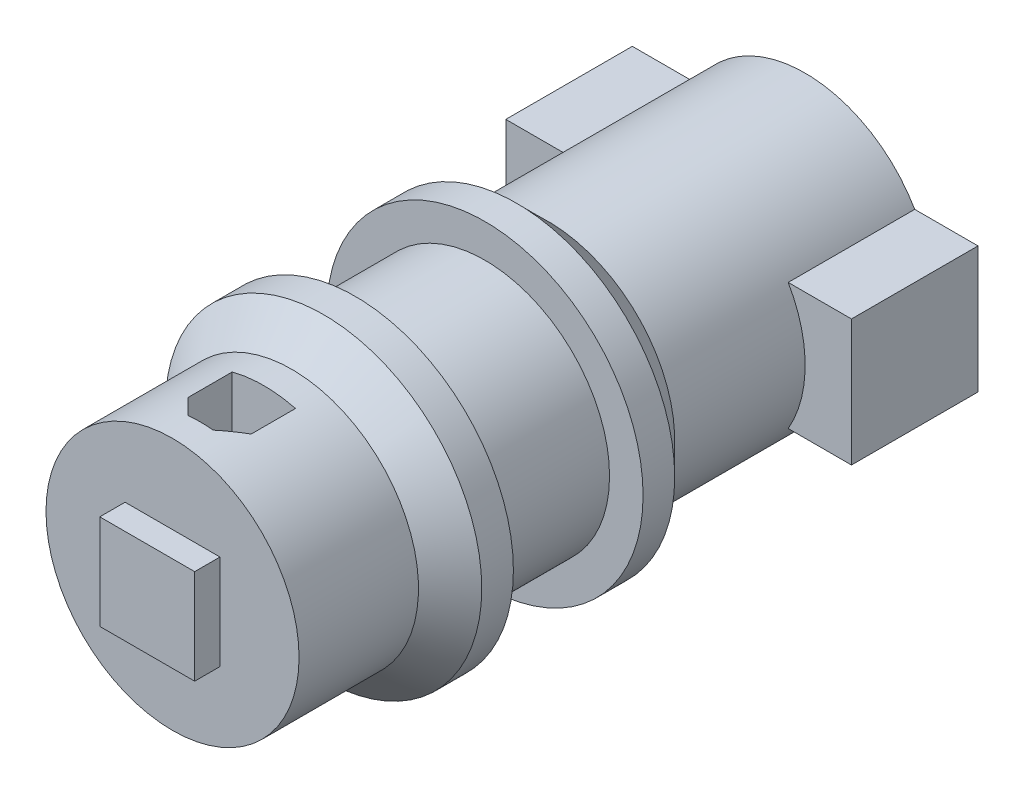
ISO-10303-21;
HEADER;
FILE_DESCRIPTION(('STEP AP214'),'2;1');
FILE_NAME('part.step','',(''),(''),'','','');
FILE_SCHEMA(('AUTOMOTIVE_DESIGN { 1 0 10303 214 1 1 1 1 }'));
ENDSEC;
DATA;
#1=APPLICATION_CONTEXT('core data for automotive mechanical design processes');
#2=APPLICATION_PROTOCOL_DEFINITION('international standard','automotive_design',2000,#1);
#3=PRODUCT_CONTEXT('',#1,'mechanical');
#4=PRODUCT('Part','Part','',(#3));
#5=PRODUCT_RELATED_PRODUCT_CATEGORY('part','',(#4));
#6=PRODUCT_DEFINITION_FORMATION('','',#4);
#7=PRODUCT_DEFINITION_CONTEXT('part definition',#1,'design');
#8=PRODUCT_DEFINITION('design','',#6,#7);
#9=PRODUCT_DEFINITION_SHAPE('','',#8);
#10=(LENGTH_UNIT() NAMED_UNIT(*) SI_UNIT(.MILLI.,.METRE.));
#11=(NAMED_UNIT(*) PLANE_ANGLE_UNIT() SI_UNIT($,.RADIAN.));
#12=(NAMED_UNIT(*) SI_UNIT($,.STERADIAN.) SOLID_ANGLE_UNIT());
#13=UNCERTAINTY_MEASURE_WITH_UNIT(LENGTH_MEASURE(1.E-05),#10,'distance_accuracy_value','');
#14=(GEOMETRIC_REPRESENTATION_CONTEXT(3) GLOBAL_UNCERTAINTY_ASSIGNED_CONTEXT((#13)) GLOBAL_UNIT_ASSIGNED_CONTEXT((#10,
#11,#12)) REPRESENTATION_CONTEXT('',''));
#15=CARTESIAN_POINT('',(0.,0.,0.));
#16=DIRECTION('',(0.,0.,1.));
#17=DIRECTION('',(1.,0.,0.));
#18=AXIS2_PLACEMENT_3D('',#15,#16,#17);
#19=CARTESIAN_POINT('',(0.,0.,35.56));
#20=DIRECTION('',(0.,0.,1.));
#21=DIRECTION('',(1.,0.,0.));
#22=AXIS2_PLACEMENT_3D('',#19,#20,#21);
#23=CYLINDRICAL_SURFACE('',#22,12.5);
#24=CARTESIAN_POINT('',(0.,0.,38.06));
#25=DIRECTION('',(0.,0.,-1.));
#26=DIRECTION('',(-1.,0.,0.));
#27=AXIS2_PLACEMENT_3D('',#24,#25,#26);
#28=CIRCLE('',#27,12.5);
#29=CARTESIAN_POINT('',(-12.5,0.,38.06));
#30=VERTEX_POINT('',#29);
#31=EDGE_CURVE('E336',#30,#30,#28,.T.);
#32=ORIENTED_EDGE('',*,*,#31,.T.);
#33=EDGE_LOOP('',(#32));
#34=FACE_BOUND('',#33,.T.);
#35=CARTESIAN_POINT('',(0.,0.,35.56));
#36=DIRECTION('',(0.,0.,-1.));
#37=DIRECTION('',(-1.,0.,0.));
#38=AXIS2_PLACEMENT_3D('',#35,#36,#37);
#39=CIRCLE('',#38,12.5);
#40=CARTESIAN_POINT('',(-12.5,0.,35.56));
#41=VERTEX_POINT('',#40);
#42=EDGE_CURVE('E230',#41,#41,#39,.T.);
#43=ORIENTED_EDGE('',*,*,#42,.F.);
#44=EDGE_LOOP('',(#43));
#45=FACE_BOUND('',#44,.T.);
#46=ADVANCED_FACE('F52',(#34,#45),#23,.T.);
#47=CARTESIAN_POINT('',(0.,0.,35.56));
#48=DIRECTION('',(0.,0.,-1.));
#49=DIRECTION('',(-1.,0.,0.));
#50=AXIS2_PLACEMENT_3D('',#47,#48,#49);
#51=PLANE('',#50);
#52=ORIENTED_EDGE('',*,*,#42,.T.);
#53=EDGE_LOOP('',(#52));
#54=FACE_BOUND('',#53,.T.);
#55=CARTESIAN_POINT('',(0.,0.,35.56));
#56=DIRECTION('',(0.,0.,-1.));
#57=DIRECTION('',(-1.,0.,0.));
#58=AXIS2_PLACEMENT_3D('',#55,#56,#57);
#59=CIRCLE('',#58,9.85);
#60=CARTESIAN_POINT('',(-9.85,0.,35.56));
#61=VERTEX_POINT('',#60);
#62=EDGE_CURVE('E529',#61,#61,#59,.T.);
#63=ORIENTED_EDGE('',*,*,#62,.F.);
#64=EDGE_LOOP('',(#63));
#65=FACE_BOUND('',#64,.T.);
#66=ADVANCED_FACE('F420',(#54,#65),#51,.T.);
#67=CARTESIAN_POINT('',(0.,0.,50.));
#68=DIRECTION('',(0.,0.,1.));
#69=DIRECTION('',(1.,0.,0.));
#70=AXIS2_PLACEMENT_3D('',#67,#68,#69);
#71=PLANE('',#70);
#72=DIRECTION('',(0.,1.,0.));
#73=VECTOR('',#72,1.);
#74=CARTESIAN_POINT('',(3.75,-3.75,50.));
#75=LINE('',#74,#73);
#76=CARTESIAN_POINT('',(3.75,-3.75,50.));
#77=VERTEX_POINT('',#76);
#78=CARTESIAN_POINT('',(3.75,3.75,50.));
#79=VERTEX_POINT('',#78);
#80=EDGE_CURVE('E69',#77,#79,#75,.T.);
#81=ORIENTED_EDGE('',*,*,#80,.F.);
#82=DIRECTION('',(1.,0.,0.));
#83=VECTOR('',#82,1.);
#84=CARTESIAN_POINT('',(-3.75,-3.75,50.));
#85=LINE('',#84,#83);
#86=CARTESIAN_POINT('',(-3.75,-3.75,50.));
#87=VERTEX_POINT('',#86);
#88=EDGE_CURVE('E73',#87,#77,#85,.T.);
#89=ORIENTED_EDGE('',*,*,#88,.F.);
#90=DIRECTION('',(0.,-1.,0.));
#91=VECTOR('',#90,1.);
#92=CARTESIAN_POINT('',(-3.75,-3.75,50.));
#93=LINE('',#92,#91);
#94=CARTESIAN_POINT('',(-3.75,3.75,50.));
#95=VERTEX_POINT('',#94);
#96=EDGE_CURVE('E551',#95,#87,#93,.T.);
#97=ORIENTED_EDGE('',*,*,#96,.F.);
#98=DIRECTION('',(-1.,0.,0.));
#99=VECTOR('',#98,1.);
#100=CARTESIAN_POINT('',(-3.75,3.75,50.));
#101=LINE('',#100,#99);
#102=EDGE_CURVE('E548',#79,#95,#101,.T.);
#103=ORIENTED_EDGE('',*,*,#102,.F.);
#104=EDGE_LOOP('',(#81,#89,#97,#103));
#105=FACE_BOUND('',#104,.T.);
#106=CARTESIAN_POINT('',(0.,0.,50.));
#107=DIRECTION('',(0.,0.,1.));
#108=DIRECTION('',(1.,0.,0.));
#109=AXIS2_PLACEMENT_3D('',#106,#107,#108);
#110=CIRCLE('',#109,10.);
#111=CARTESIAN_POINT('',(10.,0.,50.));
#112=VERTEX_POINT('',#111);
#113=EDGE_CURVE('E322',#112,#112,#110,.T.);
#114=ORIENTED_EDGE('',*,*,#113,.T.);
#115=EDGE_LOOP('',(#114));
#116=FACE_BOUND('',#115,.T.);
#117=ADVANCED_FACE('F426',(#105,#116),#71,.T.);
#118=CARTESIAN_POINT('',(0.,0.,50.));
#119=DIRECTION('',(0.,0.,-1.));
#120=DIRECTION('',(-1.,0.,0.));
#121=AXIS2_PLACEMENT_3D('',#118,#119,#120);
#122=CYLINDRICAL_SURFACE('',#121,10.);
#123=CARTESIAN_POINT('',(0.,0.,47.78));
#124=DIRECTION('',(0.,0.,1.));
#125=DIRECTION('',(1.,0.,0.));
#126=AXIS2_PLACEMENT_3D('',#123,#124,#125);
#127=CIRCLE('',#126,10.);
#128=CARTESIAN_POINT('',(1.00000000000002,9.9498743710662,47.78));
#129=VERTEX_POINT('',#128);
#130=CARTESIAN_POINT('',(-0.999999999999985,9.9498743710662,47.78));
#131=VERTEX_POINT('',#130);
#132=EDGE_CURVE('E348',#129,#131,#127,.T.);
#133=ORIENTED_EDGE('',*,*,#132,.T.);
#134=CARTESIAN_POINT('',(0.,0.,48.78));
#135=DIRECTION('',(0.707106781186544,0.,-0.707106781186551));
#136=DIRECTION('',(-0.707106781186551,0.,-0.707106781186544));
#137=AXIS2_PLACEMENT_3D('',#134,#135,#136);
#138=ELLIPSE('',#137,14.1421356237309,10.);
#139=CARTESIAN_POINT('',(-2.5,9.68245836551854,46.28));
#140=VERTEX_POINT('',#139);
#141=EDGE_CURVE('E12',#131,#140,#138,.F.);
#142=ORIENTED_EDGE('',*,*,#141,.T.);
#143=DIRECTION('',(0.,0.,-1.));
#144=VECTOR('',#143,1.);
#145=CARTESIAN_POINT('',(-2.5,9.68245836551854,50.));
#146=LINE('',#145,#144);
#147=CARTESIAN_POINT('',(-2.5,9.68245836551854,42.78));
#148=VERTEX_POINT('',#147);
#149=EDGE_CURVE('E356',#140,#148,#146,.T.);
#150=ORIENTED_EDGE('',*,*,#149,.T.);
#151=CARTESIAN_POINT('',(0.,0.,42.78));
#152=DIRECTION('',(0.,0.,-1.));
#153=DIRECTION('',(-1.,0.,0.));
#154=AXIS2_PLACEMENT_3D('',#151,#152,#153);
#155=CIRCLE('',#154,10.);
#156=CARTESIAN_POINT('',(2.5,9.68245836551854,42.78));
#157=VERTEX_POINT('',#156);
#158=EDGE_CURVE('E344',#148,#157,#155,.T.);
#159=ORIENTED_EDGE('',*,*,#158,.T.);
#160=DIRECTION('',(0.,0.,-1.));
#161=VECTOR('',#160,1.);
#162=CARTESIAN_POINT('',(2.5,9.68245836551854,50.));
#163=LINE('',#162,#161);
#164=CARTESIAN_POINT('',(2.5,9.68245836551854,46.28));
#165=VERTEX_POINT('',#164);
#166=EDGE_CURVE('E352',#157,#165,#163,.F.);
#167=ORIENTED_EDGE('',*,*,#166,.T.);
#168=CARTESIAN_POINT('',(0.,0.,48.78));
#169=DIRECTION('',(-0.707106781186554,0.,-0.707106781186541));
#170=DIRECTION('',(0.707106781186541,0.,-0.707106781186554));
#171=AXIS2_PLACEMENT_3D('',#168,#169,#170);
#172=ELLIPSE('',#171,14.1421356237311,10.);
#173=EDGE_CURVE('E62',#165,#129,#172,.F.);
#174=ORIENTED_EDGE('',*,*,#173,.T.);
#175=EDGE_LOOP('',(#133,#142,#150,#159,#167,#174));
#176=FACE_BOUND('',#175,.T.);
#177=ORIENTED_EDGE('',*,*,#113,.F.);
#178=EDGE_LOOP('',(#177));
#179=FACE_BOUND('',#178,.T.);
#180=CARTESIAN_POINT('',(0.,0.,40.56));
#181=DIRECTION('',(0.,0.,-1.));
#182=DIRECTION('',(-1.,0.,0.));
#183=AXIS2_PLACEMENT_3D('',#180,#181,#182);
#184=CIRCLE('',#183,10.);
#185=CARTESIAN_POINT('',(-10.,0.,40.56));
#186=VERTEX_POINT('',#185);
#187=EDGE_CURVE('E326',#186,#186,#184,.T.);
#188=ORIENTED_EDGE('',*,*,#187,.F.);
#189=EDGE_LOOP('',(#188));
#190=FACE_BOUND('',#189,.T.);
#191=ADVANCED_FACE('F382',(#176,#179,#190),#122,.T.);
#192=CARTESIAN_POINT('',(0.,0.,38.06));
#193=DIRECTION('',(0.,0.,-1.));
#194=DIRECTION('',(-1.,0.,0.));
#195=AXIS2_PLACEMENT_3D('',#192,#193,#194);
#196=CONICAL_SURFACE('',#195,12.5,0.785398163397449);
#197=ORIENTED_EDGE('',*,*,#187,.T.);
#198=EDGE_LOOP('',(#197));
#199=FACE_BOUND('',#198,.T.);
#200=ORIENTED_EDGE('',*,*,#31,.F.);
#201=EDGE_LOOP('',(#200));
#202=FACE_BOUND('',#201,.T.);
#203=ADVANCED_FACE('F485',(#199,#202),#196,.T.);
#204=CARTESIAN_POINT('',(2.5,5.,47.78));
#205=DIRECTION('',(1.,0.,0.));
#206=DIRECTION('',(0.,0.,-1.));
#207=AXIS2_PLACEMENT_3D('',#204,#205,#206);
#208=PLANE('',#207);
#209=DIRECTION('',(0.,0.,-1.));
#210=VECTOR('',#209,1.);
#211=CARTESIAN_POINT('',(2.5,5.,47.78));
#212=LINE('',#211,#210);
#213=CARTESIAN_POINT('',(2.5,5.,46.28));
#214=VERTEX_POINT('',#213);
#215=CARTESIAN_POINT('',(2.5,5.,42.78));
#216=VERTEX_POINT('',#215);
#217=EDGE_CURVE('E201',#214,#216,#212,.T.);
#218=ORIENTED_EDGE('',*,*,#217,.F.);
#219=DIRECTION('',(0.,1.,0.));
#220=VECTOR('',#219,1.);
#221=CARTESIAN_POINT('',(2.5,9.68245836551854,46.28));
#222=LINE('',#221,#220);
#223=EDGE_CURVE('E359',#214,#165,#222,.T.);
#224=ORIENTED_EDGE('',*,*,#223,.T.);
#225=ORIENTED_EDGE('',*,*,#166,.F.);
#226=DIRECTION('',(0.,1.,0.));
#227=VECTOR('',#226,1.);
#228=CARTESIAN_POINT('',(2.5,5.,42.78));
#229=LINE('',#228,#227);
#230=EDGE_CURVE('E225',#216,#157,#229,.T.);
#231=ORIENTED_EDGE('',*,*,#230,.F.);
#232=EDGE_LOOP('',(#218,#224,#225,#231));
#233=FACE_BOUND('',#232,.T.);
#234=ADVANCED_FACE('F399',(#233),#208,.F.);
#235=CARTESIAN_POINT('',(-2.5,5.,47.78));
#236=DIRECTION('',(0.,0.,1.));
#237=DIRECTION('',(1.,0.,0.));
#238=AXIS2_PLACEMENT_3D('',#235,#236,#237);
#239=PLANE('',#238);
#240=ORIENTED_EDGE('',*,*,#132,.F.);
#241=DIRECTION('',(0.,-1.,0.));
#242=VECTOR('',#241,1.);
#243=CARTESIAN_POINT('',(1.00000000000002,5.,47.78));
#244=LINE('',#243,#242);
#245=CARTESIAN_POINT('',(1.00000000000002,5.,47.78));
#246=VERTEX_POINT('',#245);
#247=EDGE_CURVE('E367',#129,#246,#244,.T.);
#248=ORIENTED_EDGE('',*,*,#247,.T.);
#249=DIRECTION('',(1.,0.,0.));
#250=VECTOR('',#249,1.);
#251=CARTESIAN_POINT('',(-2.5,5.,47.78));
#252=LINE('',#251,#250);
#253=CARTESIAN_POINT('',(-0.999999999999985,5.,47.78));
#254=VERTEX_POINT('',#253);
#255=EDGE_CURVE('E221',#254,#246,#252,.T.);
#256=ORIENTED_EDGE('',*,*,#255,.F.);
#257=DIRECTION('',(0.,1.,0.));
#258=VECTOR('',#257,1.);
#259=CARTESIAN_POINT('',(-0.999999999999985,9.68245836551854,47.78));
#260=LINE('',#259,#258);
#261=EDGE_CURVE('E363',#254,#131,#260,.T.);
#262=ORIENTED_EDGE('',*,*,#261,.T.);
#263=EDGE_LOOP('',(#240,#248,#256,#262));
#264=FACE_BOUND('',#263,.T.);
#265=ADVANCED_FACE('F389',(#264),#239,.F.);
#266=CARTESIAN_POINT('',(-2.5,5.,47.78));
#267=DIRECTION('',(-1.,0.,0.));
#268=DIRECTION('',(0.,0.,1.));
#269=AXIS2_PLACEMENT_3D('',#266,#267,#268);
#270=PLANE('',#269);
#271=ORIENTED_EDGE('',*,*,#149,.F.);
#272=DIRECTION('',(0.,-1.,0.));
#273=VECTOR('',#272,1.);
#274=CARTESIAN_POINT('',(-2.5,5.,46.28));
#275=LINE('',#274,#273);
#276=CARTESIAN_POINT('',(-2.5,5.,46.28));
#277=VERTEX_POINT('',#276);
#278=EDGE_CURVE('E376',#140,#277,#275,.T.);
#279=ORIENTED_EDGE('',*,*,#278,.T.);
#280=DIRECTION('',(0.,0.,1.));
#281=VECTOR('',#280,1.);
#282=CARTESIAN_POINT('',(-2.5,5.,47.78));
#283=LINE('',#282,#281);
#284=CARTESIAN_POINT('',(-2.5,5.,42.78));
#285=VERTEX_POINT('',#284);
#286=EDGE_CURVE('E217',#285,#277,#283,.T.);
#287=ORIENTED_EDGE('',*,*,#286,.F.);
#288=DIRECTION('',(0.,1.,0.));
#289=VECTOR('',#288,1.);
#290=CARTESIAN_POINT('',(-2.5,5.,42.78));
#291=LINE('',#290,#289);
#292=EDGE_CURVE('E226',#285,#148,#291,.T.);
#293=ORIENTED_EDGE('',*,*,#292,.T.);
#294=EDGE_LOOP('',(#271,#279,#287,#293));
#295=FACE_BOUND('',#294,.T.);
#296=ADVANCED_FACE('F410',(#295),#270,.F.);
#297=CARTESIAN_POINT('',(-2.5,5.,42.78));
#298=DIRECTION('',(0.,0.,-1.));
#299=DIRECTION('',(-1.,0.,0.));
#300=AXIS2_PLACEMENT_3D('',#297,#298,#299);
#301=PLANE('',#300);
#302=ORIENTED_EDGE('',*,*,#292,.F.);
#303=DIRECTION('',(-1.,0.,0.));
#304=VECTOR('',#303,1.);
#305=CARTESIAN_POINT('',(-2.5,5.,42.78));
#306=LINE('',#305,#304);
#307=EDGE_CURVE('E207',#216,#285,#306,.T.);
#308=ORIENTED_EDGE('',*,*,#307,.F.);
#309=ORIENTED_EDGE('',*,*,#230,.T.);
#310=ORIENTED_EDGE('',*,*,#158,.F.);
#311=EDGE_LOOP('',(#302,#308,#309,#310));
#312=FACE_BOUND('',#311,.T.);
#313=ADVANCED_FACE('F403',(#312),#301,.F.);
#314=CARTESIAN_POINT('',(0.,5.,0.));
#315=DIRECTION('',(0.,-1.,0.));
#316=DIRECTION('',(0.,0.,-1.));
#317=AXIS2_PLACEMENT_3D('',#314,#315,#316);
#318=PLANE('',#317);
#319=ORIENTED_EDGE('',*,*,#255,.T.);
#320=DIRECTION('',(-0.707106781186541,0.,0.707106781186554));
#321=VECTOR('',#320,1.);
#322=CARTESIAN_POINT('',(2.5,5.,46.28));
#323=LINE('',#322,#321);
#324=EDGE_CURVE('E373',#246,#214,#323,.F.);
#325=ORIENTED_EDGE('',*,*,#324,.T.);
#326=ORIENTED_EDGE('',*,*,#217,.T.);
#327=ORIENTED_EDGE('',*,*,#307,.T.);
#328=ORIENTED_EDGE('',*,*,#286,.T.);
#329=DIRECTION('',(-0.707106781186551,0.,-0.707106781186544));
#330=VECTOR('',#329,1.);
#331=CARTESIAN_POINT('',(-0.999999999999985,5.,47.78));
#332=LINE('',#331,#330);
#333=EDGE_CURVE('E370',#277,#254,#332,.F.);
#334=ORIENTED_EDGE('',*,*,#333,.T.);
#335=EDGE_LOOP('',(#319,#325,#326,#327,#328,#334));
#336=FACE_BOUND('',#335,.T.);
#337=ADVANCED_FACE('F396',(#336),#318,.F.);
#338=CARTESIAN_POINT('',(2.5,5.,46.28));
#339=DIRECTION('',(-0.707106781186554,0.,-0.707106781186541));
#340=DIRECTION('',(0.,-1.,0.));
#341=AXIS2_PLACEMENT_3D('',#338,#339,#340);
#342=PLANE('',#341);
#343=ORIENTED_EDGE('',*,*,#324,.F.);
#344=ORIENTED_EDGE('',*,*,#247,.F.);
#345=ORIENTED_EDGE('',*,*,#173,.F.);
#346=ORIENTED_EDGE('',*,*,#223,.F.);
#347=EDGE_LOOP('',(#343,#344,#345,#346));
#348=FACE_BOUND('',#347,.T.);
#349=ADVANCED_FACE('F393',(#348),#342,.T.);
#350=CARTESIAN_POINT('',(-0.999999999999985,5.,47.78));
#351=DIRECTION('',(0.707106781186544,0.,-0.707106781186551));
#352=DIRECTION('',(0.,-1.,0.));
#353=AXIS2_PLACEMENT_3D('',#350,#351,#352);
#354=PLANE('',#353);
#355=ORIENTED_EDGE('',*,*,#333,.F.);
#356=ORIENTED_EDGE('',*,*,#278,.F.);
#357=ORIENTED_EDGE('',*,*,#141,.F.);
#358=ORIENTED_EDGE('',*,*,#261,.F.);
#359=EDGE_LOOP('',(#355,#356,#357,#358));
#360=FACE_BOUND('',#359,.T.);
#361=ADVANCED_FACE('F55',(#360),#354,.T.);
#362=CARTESIAN_POINT('',(3.75,-3.75,52.));
#363=DIRECTION('',(-1.,0.,0.));
#364=DIRECTION('',(0.,0.,1.));
#365=AXIS2_PLACEMENT_3D('',#362,#363,#364);
#366=PLANE('',#365);
#367=ORIENTED_EDGE('',*,*,#80,.T.);
#368=DIRECTION('',(0.,0.,-1.));
#369=VECTOR('',#368,1.);
#370=CARTESIAN_POINT('',(3.75,3.75,52.));
#371=LINE('',#370,#369);
#372=CARTESIAN_POINT('',(3.75,3.75,52.));
#373=VERTEX_POINT('',#372);
#374=EDGE_CURVE('E181',#373,#79,#371,.T.);
#375=ORIENTED_EDGE('',*,*,#374,.F.);
#376=DIRECTION('',(0.,1.,0.));
#377=VECTOR('',#376,1.);
#378=CARTESIAN_POINT('',(3.75,-3.75,52.));
#379=LINE('',#378,#377);
#380=CARTESIAN_POINT('',(3.75,-3.75,52.));
#381=VERTEX_POINT('',#380);
#382=EDGE_CURVE('E188',#381,#373,#379,.T.);
#383=ORIENTED_EDGE('',*,*,#382,.F.);
#384=DIRECTION('',(0.,0.,-1.));
#385=VECTOR('',#384,1.);
#386=CARTESIAN_POINT('',(3.75,-3.75,52.));
#387=LINE('',#386,#385);
#388=EDGE_CURVE('E545',#381,#77,#387,.T.);
#389=ORIENTED_EDGE('',*,*,#388,.T.);
#390=EDGE_LOOP('',(#367,#375,#383,#389));
#391=FACE_BOUND('',#390,.T.);
#392=ADVANCED_FACE('F199',(#391),#366,.F.);
#393=CARTESIAN_POINT('',(-3.75,3.75,52.));
#394=DIRECTION('',(0.,-1.,0.));
#395=DIRECTION('',(0.,0.,-1.));
#396=AXIS2_PLACEMENT_3D('',#393,#394,#395);
#397=PLANE('',#396);
#398=ORIENTED_EDGE('',*,*,#102,.T.);
#399=DIRECTION('',(0.,0.,-1.));
#400=VECTOR('',#399,1.);
#401=CARTESIAN_POINT('',(-3.75,3.75,52.));
#402=LINE('',#401,#400);
#403=CARTESIAN_POINT('',(-3.75,3.75,52.));
#404=VERTEX_POINT('',#403);
#405=EDGE_CURVE('E183',#404,#95,#402,.T.);
#406=ORIENTED_EDGE('',*,*,#405,.F.);
#407=DIRECTION('',(-1.,0.,0.));
#408=VECTOR('',#407,1.);
#409=CARTESIAN_POINT('',(-3.75,3.75,52.));
#410=LINE('',#409,#408);
#411=EDGE_CURVE('E176',#373,#404,#410,.T.);
#412=ORIENTED_EDGE('',*,*,#411,.F.);
#413=ORIENTED_EDGE('',*,*,#374,.T.);
#414=EDGE_LOOP('',(#398,#406,#412,#413));
#415=FACE_BOUND('',#414,.T.);
#416=ADVANCED_FACE('F179',(#415),#397,.F.);
#417=CARTESIAN_POINT('',(-3.75,-3.75,52.));
#418=DIRECTION('',(1.,0.,0.));
#419=DIRECTION('',(0.,0.,-1.));
#420=AXIS2_PLACEMENT_3D('',#417,#418,#419);
#421=PLANE('',#420);
#422=ORIENTED_EDGE('',*,*,#96,.T.);
#423=DIRECTION('',(0.,0.,-1.));
#424=VECTOR('',#423,1.);
#425=CARTESIAN_POINT('',(-3.75,-3.75,52.));
#426=LINE('',#425,#424);
#427=CARTESIAN_POINT('',(-3.75,-3.75,52.));
#428=VERTEX_POINT('',#427);
#429=EDGE_CURVE('E210',#428,#87,#426,.T.);
#430=ORIENTED_EDGE('',*,*,#429,.F.);
#431=DIRECTION('',(0.,-1.,0.));
#432=VECTOR('',#431,1.);
#433=CARTESIAN_POINT('',(-3.75,-3.75,52.));
#434=LINE('',#433,#432);
#435=EDGE_CURVE('E187',#404,#428,#434,.T.);
#436=ORIENTED_EDGE('',*,*,#435,.F.);
#437=ORIENTED_EDGE('',*,*,#405,.T.);
#438=EDGE_LOOP('',(#422,#430,#436,#437));
#439=FACE_BOUND('',#438,.T.);
#440=ADVANCED_FACE('F512',(#439),#421,.F.);
#441=CARTESIAN_POINT('',(-3.75,-3.75,52.));
#442=DIRECTION('',(0.,1.,0.));
#443=DIRECTION('',(0.,0.,1.));
#444=AXIS2_PLACEMENT_3D('',#441,#442,#443);
#445=PLANE('',#444);
#446=ORIENTED_EDGE('',*,*,#88,.T.);
#447=ORIENTED_EDGE('',*,*,#388,.F.);
#448=DIRECTION('',(1.,0.,0.));
#449=VECTOR('',#448,1.);
#450=CARTESIAN_POINT('',(-3.75,-3.75,52.));
#451=LINE('',#450,#449);
#452=EDGE_CURVE('E193',#428,#381,#451,.T.);
#453=ORIENTED_EDGE('',*,*,#452,.F.);
#454=ORIENTED_EDGE('',*,*,#429,.T.);
#455=EDGE_LOOP('',(#446,#447,#453,#454));
#456=FACE_BOUND('',#455,.T.);
#457=ADVANCED_FACE('F515',(#456),#445,.F.);
#458=CARTESIAN_POINT('',(0.,0.,52.));
#459=DIRECTION('',(0.,0.,-1.));
#460=DIRECTION('',(-1.,0.,0.));
#461=AXIS2_PLACEMENT_3D('',#458,#459,#460);
#462=PLANE('',#461);
#463=ORIENTED_EDGE('',*,*,#382,.T.);
#464=ORIENTED_EDGE('',*,*,#411,.T.);
#465=ORIENTED_EDGE('',*,*,#435,.T.);
#466=ORIENTED_EDGE('',*,*,#452,.T.);
#467=EDGE_LOOP('',(#463,#464,#465,#466));
#468=FACE_BOUND('',#467,.T.);
#469=ADVANCED_FACE('F191',(#468),#462,.F.);
#470=CARTESIAN_POINT('',(0.,0.,63.8442712474619));
#471=DIRECTION('',(0.,0.,-1.));
#472=DIRECTION('',(-1.,0.,0.));
#473=AXIS2_PLACEMENT_3D('',#470,#471,#472);
#474=CYLINDRICAL_SURFACE('',#473,9.85);
#475=ORIENTED_EDGE('',*,*,#62,.T.);
#476=EDGE_LOOP('',(#475));
#477=FACE_BOUND('',#476,.T.);
#478=CARTESIAN_POINT('',(0.,0.,25.31));
#479=DIRECTION('',(0.,0.,1.));
#480=DIRECTION('',(1.,0.,0.));
#481=AXIS2_PLACEMENT_3D('',#478,#479,#480);
#482=CIRCLE('',#481,9.85);
#483=CARTESIAN_POINT('',(9.85,0.,25.31));
#484=VERTEX_POINT('',#483);
#485=EDGE_CURVE('E532',#484,#484,#482,.T.);
#486=ORIENTED_EDGE('',*,*,#485,.T.);
#487=EDGE_LOOP('',(#486));
#488=FACE_BOUND('',#487,.T.);
#489=ADVANCED_FACE('F451',(#477,#488),#474,.T.);
#490=CARTESIAN_POINT('',(-13.6602540378444,-5.,10.));
#491=DIRECTION('',(-1.,0.,0.));
#492=DIRECTION('',(0.,-1.,0.));
#493=AXIS2_PLACEMENT_3D('',#490,#491,#492);
#494=PLANE('',#493);
#495=DIRECTION('',(0.,1.,0.));
#496=VECTOR('',#495,1.);
#497=CARTESIAN_POINT('',(-13.6602540378444,-5.,0.));
#498=LINE('',#497,#496);
#499=CARTESIAN_POINT('',(-13.6602540378444,-5.,0.));
#500=VERTEX_POINT('',#499);
#501=CARTESIAN_POINT('',(-13.6602540378444,5.,0.));
#502=VERTEX_POINT('',#501);
#503=EDGE_CURVE('E258',#500,#502,#498,.T.);
#504=ORIENTED_EDGE('',*,*,#503,.F.);
#505=DIRECTION('',(0.,0.,-1.));
#506=VECTOR('',#505,1.);
#507=CARTESIAN_POINT('',(-13.6602540378444,-5.,10.));
#508=LINE('',#507,#506);
#509=CARTESIAN_POINT('',(-13.6602540378444,-5.,10.));
#510=VERTEX_POINT('',#509);
#511=EDGE_CURVE('E245',#510,#500,#508,.T.);
#512=ORIENTED_EDGE('',*,*,#511,.F.);
#513=DIRECTION('',(0.,1.,0.));
#514=VECTOR('',#513,1.);
#515=CARTESIAN_POINT('',(-13.6602540378444,-5.,10.));
#516=LINE('',#515,#514);
#517=CARTESIAN_POINT('',(-13.6602540378444,5.,10.));
#518=VERTEX_POINT('',#517);
#519=EDGE_CURVE('E271',#510,#518,#516,.T.);
#520=ORIENTED_EDGE('',*,*,#519,.T.);
#521=DIRECTION('',(0.,0.,-1.));
#522=VECTOR('',#521,1.);
#523=CARTESIAN_POINT('',(-13.6602540378444,5.,10.));
#524=LINE('',#523,#522);
#525=EDGE_CURVE('E247',#518,#502,#524,.T.);
#526=ORIENTED_EDGE('',*,*,#525,.T.);
#527=EDGE_LOOP('',(#504,#512,#520,#526));
#528=FACE_BOUND('',#527,.T.);
#529=ADVANCED_FACE('F447',(#528),#494,.T.);
#530=CARTESIAN_POINT('',(13.6602540378444,5.,10.));
#531=DIRECTION('',(1.,0.,0.));
#532=DIRECTION('',(0.,1.,0.));
#533=AXIS2_PLACEMENT_3D('',#530,#531,#532);
#534=PLANE('',#533);
#535=DIRECTION('',(0.,-1.,0.));
#536=VECTOR('',#535,1.);
#537=CARTESIAN_POINT('',(13.6602540378444,5.,0.));
#538=LINE('',#537,#536);
#539=CARTESIAN_POINT('',(13.6602540378444,5.,0.));
#540=VERTEX_POINT('',#539);
#541=CARTESIAN_POINT('',(13.6602540378444,-5.,0.));
#542=VERTEX_POINT('',#541);
#543=EDGE_CURVE('E301',#540,#542,#538,.T.);
#544=ORIENTED_EDGE('',*,*,#543,.F.);
#545=DIRECTION('',(0.,0.,-1.));
#546=VECTOR('',#545,1.);
#547=CARTESIAN_POINT('',(13.6602540378444,5.,10.));
#548=LINE('',#547,#546);
#549=CARTESIAN_POINT('',(13.6602540378444,5.,10.));
#550=VERTEX_POINT('',#549);
#551=EDGE_CURVE('E316',#550,#540,#548,.T.);
#552=ORIENTED_EDGE('',*,*,#551,.F.);
#553=DIRECTION('',(0.,-1.,0.));
#554=VECTOR('',#553,1.);
#555=CARTESIAN_POINT('',(13.6602540378444,5.,10.));
#556=LINE('',#555,#554);
#557=CARTESIAN_POINT('',(13.6602540378444,-5.,10.));
#558=VERTEX_POINT('',#557);
#559=EDGE_CURVE('E289',#550,#558,#556,.T.);
#560=ORIENTED_EDGE('',*,*,#559,.T.);
#561=DIRECTION('',(0.,0.,-1.));
#562=VECTOR('',#561,1.);
#563=CARTESIAN_POINT('',(13.6602540378444,-5.,10.));
#564=LINE('',#563,#562);
#565=EDGE_CURVE('E313',#558,#542,#564,.T.);
#566=ORIENTED_EDGE('',*,*,#565,.T.);
#567=EDGE_LOOP('',(#544,#552,#560,#566));
#568=FACE_BOUND('',#567,.T.);
#569=ADVANCED_FACE('F450',(#568),#534,.T.);
#570=CARTESIAN_POINT('',(8.66025403784439,5.,10.));
#571=DIRECTION('',(0.,1.,0.));
#572=DIRECTION('',(-1.,0.,0.));
#573=AXIS2_PLACEMENT_3D('',#570,#571,#572);
#574=PLANE('',#573);
#575=DIRECTION('',(1.,0.,0.));
#576=VECTOR('',#575,1.);
#577=CARTESIAN_POINT('',(8.66025403784439,5.,0.));
#578=LINE('',#577,#576);
#579=CARTESIAN_POINT('',(8.66025403784439,5.,0.));
#580=VERTEX_POINT('',#579);
#581=EDGE_CURVE('E267',#580,#540,#578,.T.);
#582=ORIENTED_EDGE('',*,*,#581,.F.);
#583=DIRECTION('',(0.,0.,-1.));
#584=VECTOR('',#583,1.);
#585=CARTESIAN_POINT('',(8.66025403784439,5.,10.));
#586=LINE('',#585,#584);
#587=CARTESIAN_POINT('',(8.66025403784439,5.,10.));
#588=VERTEX_POINT('',#587);
#589=EDGE_CURVE('E297',#588,#580,#586,.T.);
#590=ORIENTED_EDGE('',*,*,#589,.F.);
#591=DIRECTION('',(1.,0.,0.));
#592=VECTOR('',#591,1.);
#593=CARTESIAN_POINT('',(8.66025403784439,5.,10.));
#594=LINE('',#593,#592);
#595=EDGE_CURVE('E284',#588,#550,#594,.T.);
#596=ORIENTED_EDGE('',*,*,#595,.T.);
#597=ORIENTED_EDGE('',*,*,#551,.T.);
#598=EDGE_LOOP('',(#582,#590,#596,#597));
#599=FACE_BOUND('',#598,.T.);
#600=ADVANCED_FACE('F464',(#599),#574,.T.);
#601=CARTESIAN_POINT('',(0.,0.,10.));
#602=DIRECTION('',(0.,0.,-1.));
#603=DIRECTION('',(-1.,0.,0.));
#604=AXIS2_PLACEMENT_3D('',#601,#602,#603);
#605=PLANE('',#604);
#606=CARTESIAN_POINT('',(0.,0.,10.));
#607=DIRECTION('',(0.,0.,1.));
#608=DIRECTION('',(-1.,0.,0.));
#609=AXIS2_PLACEMENT_3D('',#606,#607,#608);
#610=CIRCLE('',#609,10.);
#611=CARTESIAN_POINT('',(8.66025403784439,-5.,10.));
#612=VERTEX_POINT('',#611);
#613=EDGE_CURVE('E281',#612,#588,#610,.T.);
#614=ORIENTED_EDGE('',*,*,#613,.F.);
#615=DIRECTION('',(-1.,0.,0.));
#616=VECTOR('',#615,1.);
#617=CARTESIAN_POINT('',(13.6602540378444,-5.,10.));
#618=LINE('',#617,#616);
#619=EDGE_CURVE('E293',#558,#612,#618,.T.);
#620=ORIENTED_EDGE('',*,*,#619,.F.);
#621=ORIENTED_EDGE('',*,*,#559,.F.);
#622=ORIENTED_EDGE('',*,*,#595,.F.);
#623=EDGE_LOOP('',(#614,#620,#621,#622));
#624=FACE_BOUND('',#623,.T.);
#625=ADVANCED_FACE('F461',(#624),#605,.F.);
#626=CARTESIAN_POINT('',(13.6602540378444,-5.,10.));
#627=DIRECTION('',(0.,-1.,0.));
#628=DIRECTION('',(0.,0.,-1.));
#629=AXIS2_PLACEMENT_3D('',#626,#627,#628);
#630=PLANE('',#629);
#631=DIRECTION('',(-1.,0.,0.));
#632=VECTOR('',#631,1.);
#633=CARTESIAN_POINT('',(13.6602540378444,-5.,0.));
#634=LINE('',#633,#632);
#635=CARTESIAN_POINT('',(8.66025403784439,-5.,0.));
#636=VERTEX_POINT('',#635);
#637=EDGE_CURVE('E285',#542,#636,#634,.T.);
#638=ORIENTED_EDGE('',*,*,#637,.F.);
#639=ORIENTED_EDGE('',*,*,#565,.F.);
#640=ORIENTED_EDGE('',*,*,#619,.T.);
#641=DIRECTION('',(0.,0.,-1.));
#642=VECTOR('',#641,1.);
#643=CARTESIAN_POINT('',(8.66025403784439,-5.,10.));
#644=LINE('',#643,#642);
#645=EDGE_CURVE('E308',#612,#636,#644,.T.);
#646=ORIENTED_EDGE('',*,*,#645,.T.);
#647=EDGE_LOOP('',(#638,#639,#640,#646));
#648=FACE_BOUND('',#647,.T.);
#649=ADVANCED_FACE('F445',(#648),#630,.T.);
#650=CARTESIAN_POINT('',(-8.66025403784439,-5.,10.));
#651=DIRECTION('',(0.,-1.,0.));
#652=DIRECTION('',(0.,0.,-1.));
#653=AXIS2_PLACEMENT_3D('',#650,#651,#652);
#654=PLANE('',#653);
#655=DIRECTION('',(-1.,0.,0.));
#656=VECTOR('',#655,1.);
#657=CARTESIAN_POINT('',(-8.66025403784439,-5.,0.));
#658=LINE('',#657,#656);
#659=CARTESIAN_POINT('',(-8.66025403784439,-5.,0.));
#660=VERTEX_POINT('',#659);
#661=EDGE_CURVE('E263',#660,#500,#658,.T.);
#662=ORIENTED_EDGE('',*,*,#661,.F.);
#663=DIRECTION('',(0.,0.,-1.));
#664=VECTOR('',#663,1.);
#665=CARTESIAN_POINT('',(-8.66025403784439,-5.,10.));
#666=LINE('',#665,#664);
#667=CARTESIAN_POINT('',(-8.66025403784439,-5.,10.));
#668=VERTEX_POINT('',#667);
#669=EDGE_CURVE('E240',#668,#660,#666,.T.);
#670=ORIENTED_EDGE('',*,*,#669,.F.);
#671=DIRECTION('',(-1.,0.,0.));
#672=VECTOR('',#671,1.);
#673=CARTESIAN_POINT('',(-8.66025403784439,-5.,10.));
#674=LINE('',#673,#672);
#675=EDGE_CURVE('E275',#668,#510,#674,.T.);
#676=ORIENTED_EDGE('',*,*,#675,.T.);
#677=ORIENTED_EDGE('',*,*,#511,.T.);
#678=EDGE_LOOP('',(#662,#670,#676,#677));
#679=FACE_BOUND('',#678,.T.);
#680=ADVANCED_FACE('F441',(#679),#654,.T.);
#681=CARTESIAN_POINT('',(0.,0.,10.));
#682=DIRECTION('',(0.,0.,-1.));
#683=DIRECTION('',(-1.,0.,0.));
#684=AXIS2_PLACEMENT_3D('',#681,#682,#683);
#685=PLANE('',#684);
#686=CARTESIAN_POINT('',(0.,0.,10.));
#687=DIRECTION('',(0.,0.,1.));
#688=DIRECTION('',(-1.,0.,0.));
#689=AXIS2_PLACEMENT_3D('',#686,#687,#688);
#690=CIRCLE('',#689,10.);
#691=CARTESIAN_POINT('',(-8.66025403784439,5.,10.));
#692=VERTEX_POINT('',#691);
#693=EDGE_CURVE('E259',#692,#668,#690,.T.);
#694=ORIENTED_EDGE('',*,*,#693,.F.);
#695=DIRECTION('',(1.,0.,0.));
#696=VECTOR('',#695,1.);
#697=CARTESIAN_POINT('',(-13.6602540378444,5.,10.));
#698=LINE('',#697,#696);
#699=EDGE_CURVE('E244',#518,#692,#698,.T.);
#700=ORIENTED_EDGE('',*,*,#699,.F.);
#701=ORIENTED_EDGE('',*,*,#519,.F.);
#702=ORIENTED_EDGE('',*,*,#675,.F.);
#703=EDGE_LOOP('',(#694,#700,#701,#702));
#704=FACE_BOUND('',#703,.T.);
#705=ADVANCED_FACE('F444',(#704),#685,.F.);
#706=CARTESIAN_POINT('',(-13.6602540378444,5.,10.));
#707=DIRECTION('',(0.,1.,0.));
#708=DIRECTION('',(-1.,0.,0.));
#709=AXIS2_PLACEMENT_3D('',#706,#707,#708);
#710=PLANE('',#709);
#711=DIRECTION('',(1.,0.,0.));
#712=VECTOR('',#711,1.);
#713=CARTESIAN_POINT('',(-13.6602540378444,5.,0.));
#714=LINE('',#713,#712);
#715=CARTESIAN_POINT('',(-8.66025403784439,5.,0.));
#716=VERTEX_POINT('',#715);
#717=EDGE_CURVE('E254',#502,#716,#714,.T.);
#718=ORIENTED_EDGE('',*,*,#717,.F.);
#719=ORIENTED_EDGE('',*,*,#525,.F.);
#720=ORIENTED_EDGE('',*,*,#699,.T.);
#721=DIRECTION('',(0.,0.,-1.));
#722=VECTOR('',#721,1.);
#723=CARTESIAN_POINT('',(-8.66025403784439,5.,10.));
#724=LINE('',#723,#722);
#725=EDGE_CURVE('E250',#692,#716,#724,.T.);
#726=ORIENTED_EDGE('',*,*,#725,.T.);
#727=EDGE_LOOP('',(#718,#719,#720,#726));
#728=FACE_BOUND('',#727,.T.);
#729=ADVANCED_FACE('F453',(#728),#710,.T.);
#730=CARTESIAN_POINT('',(0.,0.,0.));
#731=DIRECTION('',(0.,0.,1.));
#732=DIRECTION('',(1.,0.,0.));
#733=AXIS2_PLACEMENT_3D('',#730,#731,#732);
#734=PLANE('',#733);
#735=CARTESIAN_POINT('',(0.,0.,0.));
#736=DIRECTION('',(0.,0.,1.));
#737=DIRECTION('',(1.,0.,0.));
#738=AXIS2_PLACEMENT_3D('',#735,#736,#737);
#739=CIRCLE('',#738,10.);
#740=EDGE_CURVE('E327',#580,#716,#739,.T.);
#741=ORIENTED_EDGE('',*,*,#740,.F.);
#742=ORIENTED_EDGE('',*,*,#581,.T.);
#743=ORIENTED_EDGE('',*,*,#543,.T.);
#744=ORIENTED_EDGE('',*,*,#637,.T.);
#745=EDGE_CURVE('E312',#660,#636,#739,.T.);
#746=ORIENTED_EDGE('',*,*,#745,.F.);
#747=ORIENTED_EDGE('',*,*,#661,.T.);
#748=ORIENTED_EDGE('',*,*,#503,.T.);
#749=ORIENTED_EDGE('',*,*,#717,.T.);
#750=EDGE_LOOP('',(#741,#742,#743,#744,#746,#747,#748,#749));
#751=FACE_BOUND('',#750,.T.);
#752=ADVANCED_FACE('F456',(#751),#734,.F.);
#753=CARTESIAN_POINT('',(0.,0.,20.31));
#754=DIRECTION('',(0.,0.,-1.));
#755=DIRECTION('',(-1.,0.,0.));
#756=AXIS2_PLACEMENT_3D('',#753,#754,#755);
#757=CIRCLE('',#756,10.);
#758=CARTESIAN_POINT('',(-10.,0.,20.31));
#759=VERTEX_POINT('',#758);
#760=EDGE_CURVE('E239',#759,#759,#757,.T.);
#761=ORIENTED_EDGE('',*,*,#760,.T.);
#762=EDGE_LOOP('',(#761));
#763=FACE_BOUND('',#762,.T.);
#764=ORIENTED_EDGE('',*,*,#740,.T.);
#765=ORIENTED_EDGE('',*,*,#725,.F.);
#766=ORIENTED_EDGE('',*,*,#693,.T.);
#767=ORIENTED_EDGE('',*,*,#669,.T.);
#768=ORIENTED_EDGE('',*,*,#745,.T.);
#769=ORIENTED_EDGE('',*,*,#645,.F.);
#770=ORIENTED_EDGE('',*,*,#613,.T.);
#771=ORIENTED_EDGE('',*,*,#589,.T.);
#772=EDGE_LOOP('',(#764,#765,#766,#767,#768,#769,#770,#771));
#773=FACE_BOUND('',#772,.T.);
#774=ADVANCED_FACE('F479',(#763,#773),#122,.T.);
#775=CARTESIAN_POINT('',(0.,0.,20.31));
#776=DIRECTION('',(0.,0.,1.));
#777=DIRECTION('',(1.,0.,0.));
#778=AXIS2_PLACEMENT_3D('',#775,#776,#777);
#779=CONICAL_SURFACE('',#778,9.99999999999999,0.785398163397445);
#780=CARTESIAN_POINT('',(0.,0.,22.81));
#781=DIRECTION('',(0.,0.,-1.));
#782=DIRECTION('',(-1.,0.,0.));
#783=AXIS2_PLACEMENT_3D('',#780,#781,#782);
#784=CIRCLE('',#783,12.5);
#785=CARTESIAN_POINT('',(-12.5,0.,22.81));
#786=VERTEX_POINT('',#785);
#787=EDGE_CURVE('E340',#786,#786,#784,.F.);
#788=ORIENTED_EDGE('',*,*,#787,.F.);
#789=EDGE_LOOP('',(#788));
#790=FACE_BOUND('',#789,.T.);
#791=ORIENTED_EDGE('',*,*,#760,.F.);
#792=EDGE_LOOP('',(#791));
#793=FACE_BOUND('',#792,.T.);
#794=ADVANCED_FACE('F439',(#790,#793),#779,.T.);
#795=CARTESIAN_POINT('',(0.,0.,20.31));
#796=DIRECTION('',(0.,0.,1.));
#797=DIRECTION('',(1.,0.,0.));
#798=AXIS2_PLACEMENT_3D('',#795,#796,#797);
#799=CYLINDRICAL_SURFACE('',#798,12.5);
#800=ORIENTED_EDGE('',*,*,#787,.T.);
#801=EDGE_LOOP('',(#800));
#802=FACE_BOUND('',#801,.T.);
#803=CARTESIAN_POINT('',(0.,0.,25.31));
#804=DIRECTION('',(0.,0.,-1.));
#805=DIRECTION('',(-1.,0.,0.));
#806=AXIS2_PLACEMENT_3D('',#803,#804,#805);
#807=CIRCLE('',#806,12.5);
#808=CARTESIAN_POINT('',(-12.5,0.,25.31));
#809=VERTEX_POINT('',#808);
#810=EDGE_CURVE('E235',#809,#809,#807,.T.);
#811=ORIENTED_EDGE('',*,*,#810,.T.);
#812=EDGE_LOOP('',(#811));
#813=FACE_BOUND('',#812,.T.);
#814=ADVANCED_FACE('F435',(#802,#813),#799,.T.);
#815=CARTESIAN_POINT('',(0.,0.,25.31));
#816=DIRECTION('',(0.,0.,-1.));
#817=DIRECTION('',(-1.,0.,0.));
#818=AXIS2_PLACEMENT_3D('',#815,#816,#817);
#819=PLANE('',#818);
#820=ORIENTED_EDGE('',*,*,#810,.F.);
#821=EDGE_LOOP('',(#820));
#822=FACE_BOUND('',#821,.T.);
#823=ORIENTED_EDGE('',*,*,#485,.F.);
#824=EDGE_LOOP('',(#823));
#825=FACE_BOUND('',#824,.T.);
#826=ADVANCED_FACE('F432',(#822,#825),#819,.F.);
#827=CLOSED_SHELL('',(#46,#66,#117,#191,#203,#234,#265,#296,#313,#337,#349,#361,#392,#416,#440,
#457,#469,#489,#529,#569,#600,#625,#649,#680,#705,#729,#752,#774,#794,#814,#826));
#828=MANIFOLD_SOLID_BREP('B2',#827);
#829=ADVANCED_BREP_SHAPE_REPRESENTATION('',(#18,#828),#14);
#830=SHAPE_DEFINITION_REPRESENTATION(#9,#829);
ENDSEC;
END-ISO-10303-21;
